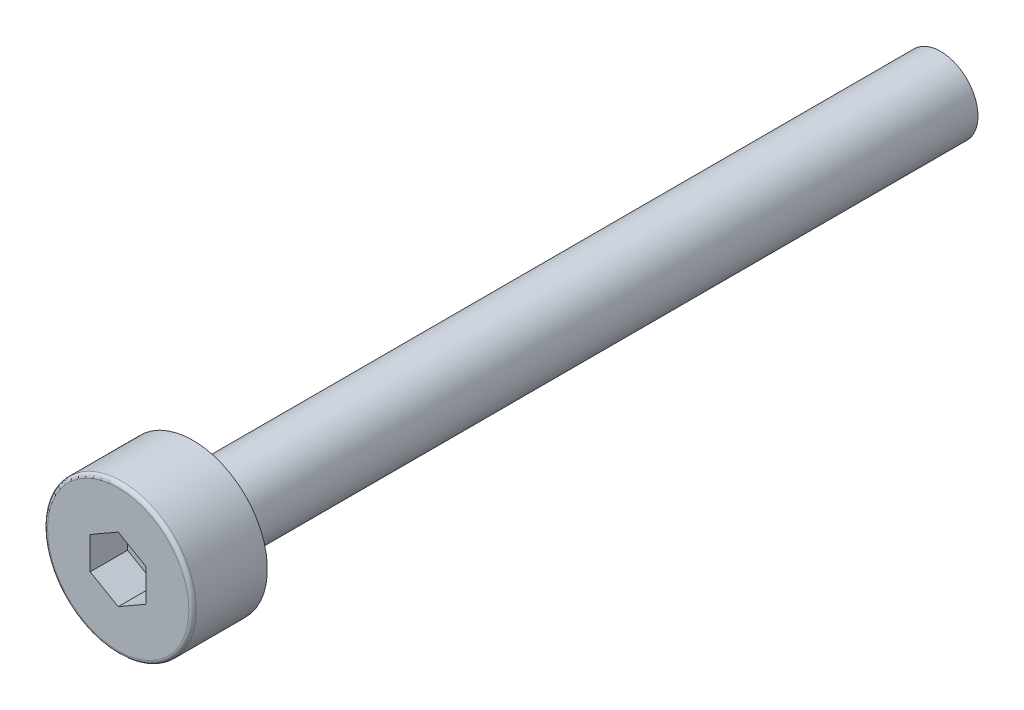
ISO-10303-21;
HEADER;
FILE_DESCRIPTION(('STEP AP214'),'2;1');
FILE_NAME('part.step','',(''),(''),'','','');
FILE_SCHEMA(('AUTOMOTIVE_DESIGN { 1 0 10303 214 1 1 1 1 }'));
ENDSEC;
DATA;
#1=APPLICATION_CONTEXT('core data for automotive mechanical design processes');
#2=APPLICATION_PROTOCOL_DEFINITION('international standard','automotive_design',2000,#1);
#3=PRODUCT_CONTEXT('',#1,'mechanical');
#4=PRODUCT('Part','Part','',(#3));
#5=PRODUCT_RELATED_PRODUCT_CATEGORY('part','',(#4));
#6=PRODUCT_DEFINITION_FORMATION('','',#4);
#7=PRODUCT_DEFINITION_CONTEXT('part definition',#1,'design');
#8=PRODUCT_DEFINITION('design','',#6,#7);
#9=PRODUCT_DEFINITION_SHAPE('','',#8);
#10=(LENGTH_UNIT() NAMED_UNIT(*) SI_UNIT(.MILLI.,.METRE.));
#11=(NAMED_UNIT(*) PLANE_ANGLE_UNIT() SI_UNIT($,.RADIAN.));
#12=(NAMED_UNIT(*) SI_UNIT($,.STERADIAN.) SOLID_ANGLE_UNIT());
#13=UNCERTAINTY_MEASURE_WITH_UNIT(LENGTH_MEASURE(1.E-05),#10,'distance_accuracy_value','');
#14=(GEOMETRIC_REPRESENTATION_CONTEXT(3) GLOBAL_UNCERTAINTY_ASSIGNED_CONTEXT((#13)) GLOBAL_UNIT_ASSIGNED_CONTEXT((#10,
#11,#12)) REPRESENTATION_CONTEXT('',''));
#15=CARTESIAN_POINT('',(0.,0.,0.));
#16=DIRECTION('',(0.,0.,1.));
#17=DIRECTION('',(1.,0.,0.));
#18=AXIS2_PLACEMENT_3D('',#15,#16,#17);
#19=CARTESIAN_POINT('',(0.,0.,1.));
#20=DIRECTION('',(0.,0.,1.));
#21=DIRECTION('',(1.,0.,0.));
#22=AXIS2_PLACEMENT_3D('',#19,#20,#21);
#23=PLANE('',#22);
#24=DIRECTION('',(-0.866025403784439,-0.5,0.));
#25=VECTOR('',#24,1.);
#26=CARTESIAN_POINT('',(0.,0.865000000000001,1.));
#27=LINE('',#26,#25);
#28=CARTESIAN_POINT('',(0.,0.865000000000001,1.));
#29=VERTEX_POINT('',#28);
#30=CARTESIAN_POINT('',(-0.749111974273539,0.4325,1.));
#31=VERTEX_POINT('',#30);
#32=EDGE_CURVE('E61',#29,#31,#27,.T.);
#33=ORIENTED_EDGE('',*,*,#32,.T.);
#34=DIRECTION('',(0.,1.,0.));
#35=VECTOR('',#34,1.);
#36=CARTESIAN_POINT('',(-0.749111974273539,0.4325,1.));
#37=LINE('',#36,#35);
#38=CARTESIAN_POINT('',(-0.749111974273539,-0.4325,1.));
#39=VERTEX_POINT('',#38);
#40=EDGE_CURVE('E63',#31,#39,#37,.F.);
#41=ORIENTED_EDGE('',*,*,#40,.T.);
#42=DIRECTION('',(0.866025403784439,-0.5,0.));
#43=VECTOR('',#42,1.);
#44=CARTESIAN_POINT('',(-0.749111974273539,-0.4325,1.));
#45=LINE('',#44,#43);
#46=CARTESIAN_POINT('',(0.,-0.865,1.));
#47=VERTEX_POINT('',#46);
#48=EDGE_CURVE('E65',#39,#47,#45,.T.);
#49=ORIENTED_EDGE('',*,*,#48,.T.);
#50=DIRECTION('',(0.866025403784438,0.5,0.));
#51=VECTOR('',#50,1.);
#52=CARTESIAN_POINT('',(0.,-0.865,1.));
#53=LINE('',#52,#51);
#54=CARTESIAN_POINT('',(0.749111974273539,-0.4325,1.));
#55=VERTEX_POINT('',#54);
#56=EDGE_CURVE('E134',#47,#55,#53,.T.);
#57=ORIENTED_EDGE('',*,*,#56,.T.);
#58=DIRECTION('',(0.,1.,0.));
#59=VECTOR('',#58,1.);
#60=CARTESIAN_POINT('',(0.749111974273539,-0.4325,1.));
#61=LINE('',#60,#59);
#62=CARTESIAN_POINT('',(0.749111974273539,0.432500000000001,1.));
#63=VERTEX_POINT('',#62);
#64=EDGE_CURVE('E140',#55,#63,#61,.T.);
#65=ORIENTED_EDGE('',*,*,#64,.T.);
#66=DIRECTION('',(-0.866025403784439,0.5,0.));
#67=VECTOR('',#66,1.);
#68=CARTESIAN_POINT('',(0.749111974273539,0.432500000000001,1.));
#69=LINE('',#68,#67);
#70=EDGE_CURVE('E145',#63,#29,#69,.T.);
#71=ORIENTED_EDGE('',*,*,#70,.T.);
#72=EDGE_LOOP('',(#33,#41,#49,#57,#65,#71));
#73=FACE_BOUND('',#72,.T.);
#74=ADVANCED_FACE('F17',(#73),#23,.T.);
#75=CARTESIAN_POINT('',(-0.749111974273539,-0.4325,1.));
#76=DIRECTION('',(-0.5,-0.866025403784439,0.));
#77=DIRECTION('',(0.866025403784439,-0.5,0.));
#78=AXIS2_PLACEMENT_3D('',#75,#76,#77);
#79=PLANE('',#78);
#80=DIRECTION('',(0.,0.,1.));
#81=VECTOR('',#80,1.);
#82=CARTESIAN_POINT('',(0.,-0.865,1.));
#83=LINE('',#82,#81);
#84=CARTESIAN_POINT('',(0.,-0.865,2.));
#85=VERTEX_POINT('',#84);
#86=EDGE_CURVE('E79',#85,#47,#83,.F.);
#87=ORIENTED_EDGE('',*,*,#86,.T.);
#88=ORIENTED_EDGE('',*,*,#48,.F.);
#89=DIRECTION('',(0.,0.,1.));
#90=VECTOR('',#89,1.);
#91=CARTESIAN_POINT('',(-0.749111974273539,-0.4325,1.));
#92=LINE('',#91,#90);
#93=CARTESIAN_POINT('',(-0.749111974273539,-0.4325,2.));
#94=VERTEX_POINT('',#93);
#95=EDGE_CURVE('E71',#39,#94,#92,.T.);
#96=ORIENTED_EDGE('',*,*,#95,.T.);
#97=DIRECTION('',(-0.866025403784439,0.5,0.));
#98=VECTOR('',#97,1.);
#99=CARTESIAN_POINT('',(0.,-0.865,2.));
#100=LINE('',#99,#98);
#101=EDGE_CURVE('E133',#85,#94,#100,.T.);
#102=ORIENTED_EDGE('',*,*,#101,.F.);
#103=EDGE_LOOP('',(#87,#88,#96,#102));
#104=FACE_BOUND('',#103,.T.);
#105=ADVANCED_FACE('F75',(#104),#79,.F.);
#106=CARTESIAN_POINT('',(-0.749111974273539,0.4325,1.));
#107=DIRECTION('',(-1.,0.,0.));
#108=DIRECTION('',(0.,0.,1.));
#109=AXIS2_PLACEMENT_3D('',#106,#107,#108);
#110=PLANE('',#109);
#111=ORIENTED_EDGE('',*,*,#95,.F.);
#112=ORIENTED_EDGE('',*,*,#40,.F.);
#113=DIRECTION('',(0.,0.,1.));
#114=VECTOR('',#113,1.);
#115=CARTESIAN_POINT('',(-0.749111974273539,0.4325,1.));
#116=LINE('',#115,#114);
#117=CARTESIAN_POINT('',(-0.749111974273539,0.4325,2.));
#118=VERTEX_POINT('',#117);
#119=EDGE_CURVE('E87',#31,#118,#116,.T.);
#120=ORIENTED_EDGE('',*,*,#119,.T.);
#121=DIRECTION('',(0.,1.,0.));
#122=VECTOR('',#121,1.);
#123=CARTESIAN_POINT('',(-0.749111974273539,0.,2.));
#124=LINE('',#123,#122);
#125=EDGE_CURVE('E84',#94,#118,#124,.T.);
#126=ORIENTED_EDGE('',*,*,#125,.F.);
#127=EDGE_LOOP('',(#111,#112,#120,#126));
#128=FACE_BOUND('',#127,.T.);
#129=ADVANCED_FACE('F82',(#128),#110,.F.);
#130=CARTESIAN_POINT('',(0.,0.865000000000001,1.));
#131=DIRECTION('',(-0.5,0.866025403784439,0.));
#132=DIRECTION('',(-0.866025403784439,-0.5,0.));
#133=AXIS2_PLACEMENT_3D('',#130,#131,#132);
#134=PLANE('',#133);
#135=ORIENTED_EDGE('',*,*,#119,.F.);
#136=ORIENTED_EDGE('',*,*,#32,.F.);
#137=DIRECTION('',(0.,0.,1.));
#138=VECTOR('',#137,1.);
#139=CARTESIAN_POINT('',(0.,0.865000000000001,1.));
#140=LINE('',#139,#138);
#141=CARTESIAN_POINT('',(0.,0.865000000000001,2.));
#142=VERTEX_POINT('',#141);
#143=EDGE_CURVE('E142',#29,#142,#140,.T.);
#144=ORIENTED_EDGE('',*,*,#143,.T.);
#145=DIRECTION('',(0.866025403784439,0.5,0.));
#146=VECTOR('',#145,1.);
#147=CARTESIAN_POINT('',(-0.749111974273539,0.4325,2.));
#148=LINE('',#147,#146);
#149=EDGE_CURVE('E152',#118,#142,#148,.T.);
#150=ORIENTED_EDGE('',*,*,#149,.F.);
#151=EDGE_LOOP('',(#135,#136,#144,#150));
#152=FACE_BOUND('',#151,.T.);
#153=ADVANCED_FACE('F153',(#152),#134,.F.);
#154=CARTESIAN_POINT('',(0.749111974273539,0.432500000000001,1.));
#155=DIRECTION('',(0.5,0.866025403784439,0.));
#156=DIRECTION('',(-0.866025403784439,0.5,0.));
#157=AXIS2_PLACEMENT_3D('',#154,#155,#156);
#158=PLANE('',#157);
#159=ORIENTED_EDGE('',*,*,#143,.F.);
#160=ORIENTED_EDGE('',*,*,#70,.F.);
#161=DIRECTION('',(0.,0.,-1.));
#162=VECTOR('',#161,1.);
#163=CARTESIAN_POINT('',(0.749111974273539,0.432500000000001,1.));
#164=LINE('',#163,#162);
#165=CARTESIAN_POINT('',(0.749111974273539,0.432500000000001,2.));
#166=VERTEX_POINT('',#165);
#167=EDGE_CURVE('E137',#63,#166,#164,.F.);
#168=ORIENTED_EDGE('',*,*,#167,.T.);
#169=DIRECTION('',(0.866025403784439,-0.5,0.));
#170=VECTOR('',#169,1.);
#171=CARTESIAN_POINT('',(0.,0.865000000000001,2.));
#172=LINE('',#171,#170);
#173=EDGE_CURVE('E158',#142,#166,#172,.T.);
#174=ORIENTED_EDGE('',*,*,#173,.F.);
#175=EDGE_LOOP('',(#159,#160,#168,#174));
#176=FACE_BOUND('',#175,.T.);
#177=ADVANCED_FACE('F241',(#176),#158,.F.);
#178=CARTESIAN_POINT('',(0.749111974273539,-0.4325,1.));
#179=DIRECTION('',(1.,0.,0.));
#180=DIRECTION('',(0.,0.,-1.));
#181=AXIS2_PLACEMENT_3D('',#178,#179,#180);
#182=PLANE('',#181);
#183=ORIENTED_EDGE('',*,*,#167,.F.);
#184=ORIENTED_EDGE('',*,*,#64,.F.);
#185=DIRECTION('',(0.,0.,1.));
#186=VECTOR('',#185,1.);
#187=CARTESIAN_POINT('',(0.749111974273539,-0.432499999999999,1.));
#188=LINE('',#187,#186);
#189=CARTESIAN_POINT('',(0.749111974273539,-0.4325,2.));
#190=VERTEX_POINT('',#189);
#191=EDGE_CURVE('E125',#55,#190,#188,.T.);
#192=ORIENTED_EDGE('',*,*,#191,.T.);
#193=DIRECTION('',(0.,1.,0.));
#194=VECTOR('',#193,1.);
#195=CARTESIAN_POINT('',(0.749111974273539,0.,2.));
#196=LINE('',#195,#194);
#197=EDGE_CURVE('E166',#166,#190,#196,.F.);
#198=ORIENTED_EDGE('',*,*,#197,.F.);
#199=EDGE_LOOP('',(#183,#184,#192,#198));
#200=FACE_BOUND('',#199,.T.);
#201=ADVANCED_FACE('F191',(#200),#182,.F.);
#202=CARTESIAN_POINT('',(0.,-0.865,1.));
#203=DIRECTION('',(0.5,-0.866025403784438,0.));
#204=DIRECTION('',(0.866025403784438,0.5,0.));
#205=AXIS2_PLACEMENT_3D('',#202,#203,#204);
#206=PLANE('',#205);
#207=ORIENTED_EDGE('',*,*,#191,.F.);
#208=ORIENTED_EDGE('',*,*,#56,.F.);
#209=ORIENTED_EDGE('',*,*,#86,.F.);
#210=DIRECTION('',(-0.866025403784438,-0.5,0.));
#211=VECTOR('',#210,1.);
#212=CARTESIAN_POINT('',(0.749111974273539,-0.4325,2.));
#213=LINE('',#212,#211);
#214=EDGE_CURVE('E168',#190,#85,#213,.T.);
#215=ORIENTED_EDGE('',*,*,#214,.F.);
#216=EDGE_LOOP('',(#207,#208,#209,#215));
#217=FACE_BOUND('',#216,.T.);
#218=ADVANCED_FACE('F186',(#217),#206,.F.);
#219=CARTESIAN_POINT('',(0.,0.,2.));
#220=DIRECTION('',(0.,0.,1.));
#221=DIRECTION('',(1.,0.,0.));
#222=AXIS2_PLACEMENT_3D('',#219,#220,#221);
#223=PLANE('',#222);
#224=ORIENTED_EDGE('',*,*,#197,.T.);
#225=ORIENTED_EDGE('',*,*,#214,.T.);
#226=ORIENTED_EDGE('',*,*,#101,.T.);
#227=ORIENTED_EDGE('',*,*,#125,.T.);
#228=ORIENTED_EDGE('',*,*,#149,.T.);
#229=ORIENTED_EDGE('',*,*,#173,.T.);
#230=EDGE_LOOP('',(#224,#225,#226,#227,#228,#229));
#231=FACE_BOUND('',#230,.T.);
#232=CARTESIAN_POINT('',(0.,0.,2.));
#233=DIRECTION('',(0.,0.,-1.));
#234=DIRECTION('',(-1.,0.,0.));
#235=AXIS2_PLACEMENT_3D('',#232,#233,#234);
#236=CIRCLE('',#235,1.89);
#237=CARTESIAN_POINT('',(-1.89,0.,2.));
#238=VERTEX_POINT('',#237);
#239=CARTESIAN_POINT('',(1.89,0.,2.));
#240=VERTEX_POINT('',#239);
#241=EDGE_CURVE('E36',#238,#240,#236,.T.);
#242=ORIENTED_EDGE('',*,*,#241,.F.);
#243=CARTESIAN_POINT('',(0.,0.,2.));
#244=DIRECTION('',(0.,0.,-1.));
#245=DIRECTION('',(1.,0.,0.));
#246=AXIS2_PLACEMENT_3D('',#243,#244,#245);
#247=CIRCLE('',#246,1.89);
#248=EDGE_CURVE('E99',#240,#238,#247,.T.);
#249=ORIENTED_EDGE('',*,*,#248,.F.);
#250=EDGE_LOOP('',(#242,#249));
#251=FACE_BOUND('',#250,.T.);
#252=ADVANCED_FACE('F113',(#231,#251),#223,.T.);
#253=CARTESIAN_POINT('',(0.,0.,1.9));
#254=DIRECTION('',(0.,0.,1.));
#255=DIRECTION('',(1.,0.,0.));
#256=AXIS2_PLACEMENT_3D('',#253,#254,#255);
#257=TOROIDAL_SURFACE('',#256,1.89,0.1);
#258=CARTESIAN_POINT('',(0.,0.,1.9));
#259=DIRECTION('',(0.,0.,-1.));
#260=DIRECTION('',(-1.,0.,0.));
#261=AXIS2_PLACEMENT_3D('',#258,#259,#260);
#262=CIRCLE('',#261,1.99);
#263=CARTESIAN_POINT('',(-1.99,0.,1.9));
#264=VERTEX_POINT('',#263);
#265=EDGE_CURVE('E95',#264,#264,#262,.T.);
#266=ORIENTED_EDGE('',*,*,#265,.F.);
#267=EDGE_LOOP('',(#266));
#268=FACE_BOUND('',#267,.T.);
#269=ORIENTED_EDGE('',*,*,#248,.T.);
#270=ORIENTED_EDGE('',*,*,#241,.T.);
#271=EDGE_LOOP('',(#269,#270));
#272=FACE_BOUND('',#271,.T.);
#273=ADVANCED_FACE('F107',(#268,#272),#257,.T.);
#274=CARTESIAN_POINT('',(0.,0.,2.));
#275=DIRECTION('',(0.,0.,-1.));
#276=DIRECTION('',(-1.,0.,0.));
#277=AXIS2_PLACEMENT_3D('',#274,#275,#276);
#278=CYLINDRICAL_SURFACE('',#277,1.99);
#279=ORIENTED_EDGE('',*,*,#265,.T.);
#280=EDGE_LOOP('',(#279));
#281=FACE_BOUND('',#280,.T.);
#282=CARTESIAN_POINT('',(0.,0.,0.));
#283=DIRECTION('',(0.,0.,-1.));
#284=DIRECTION('',(-1.,0.,0.));
#285=AXIS2_PLACEMENT_3D('',#282,#283,#284);
#286=CIRCLE('',#285,1.99);
#287=CARTESIAN_POINT('',(-1.99,0.,0.));
#288=VERTEX_POINT('',#287);
#289=EDGE_CURVE('E93',#288,#288,#286,.F.);
#290=ORIENTED_EDGE('',*,*,#289,.T.);
#291=EDGE_LOOP('',(#290));
#292=FACE_BOUND('',#291,.T.);
#293=ADVANCED_FACE('F112',(#281,#292),#278,.T.);
#294=CARTESIAN_POINT('',(0.,0.,-20.));
#295=DIRECTION('',(0.,0.,-1.));
#296=DIRECTION('',(-1.,0.,0.));
#297=AXIS2_PLACEMENT_3D('',#294,#295,#296);
#298=PLANE('',#297);
#299=CARTESIAN_POINT('',(0.,0.,-20.));
#300=DIRECTION('',(0.,0.,1.));
#301=DIRECTION('',(1.,0.,0.));
#302=AXIS2_PLACEMENT_3D('',#299,#300,#301);
#303=CIRCLE('',#302,1.);
#304=CARTESIAN_POINT('',(1.,0.,-20.));
#305=VERTEX_POINT('',#304);
#306=EDGE_CURVE('E28',#305,#305,#303,.T.);
#307=ORIENTED_EDGE('',*,*,#306,.F.);
#308=EDGE_LOOP('',(#307));
#309=FACE_BOUND('',#308,.T.);
#310=ADVANCED_FACE('F201',(#309),#298,.T.);
#311=CARTESIAN_POINT('',(0.,0.,0.));
#312=DIRECTION('',(0.,0.,1.));
#313=DIRECTION('',(1.,0.,0.));
#314=AXIS2_PLACEMENT_3D('',#311,#312,#313);
#315=PLANE('',#314);
#316=CARTESIAN_POINT('',(0.,0.,0.));
#317=DIRECTION('',(0.,0.,1.));
#318=DIRECTION('',(1.,0.,0.));
#319=AXIS2_PLACEMENT_3D('',#316,#317,#318);
#320=CIRCLE('',#319,1.);
#321=CARTESIAN_POINT('',(1.,0.,0.));
#322=VERTEX_POINT('',#321);
#323=EDGE_CURVE('E11',#322,#322,#320,.F.);
#324=ORIENTED_EDGE('',*,*,#323,.F.);
#325=EDGE_LOOP('',(#324));
#326=FACE_BOUND('',#325,.T.);
#327=ORIENTED_EDGE('',*,*,#289,.F.);
#328=EDGE_LOOP('',(#327));
#329=FACE_BOUND('',#328,.T.);
#330=ADVANCED_FACE('F195',(#326,#329),#315,.F.);
#331=CARTESIAN_POINT('',(0.,0.,-20.));
#332=DIRECTION('',(0.,0.,1.));
#333=DIRECTION('',(1.,0.,0.));
#334=AXIS2_PLACEMENT_3D('',#331,#332,#333);
#335=CYLINDRICAL_SURFACE('',#334,1.);
#336=ORIENTED_EDGE('',*,*,#323,.T.);
#337=EDGE_LOOP('',(#336));
#338=FACE_BOUND('',#337,.T.);
#339=ORIENTED_EDGE('',*,*,#306,.T.);
#340=EDGE_LOOP('',(#339));
#341=FACE_BOUND('',#340,.T.);
#342=ADVANCED_FACE('F193',(#338,#341),#335,.T.);
#343=CLOSED_SHELL('',(#74,#105,#129,#153,#177,#201,#218,#252,#273,#293,#310,#330,#342));
#344=MANIFOLD_SOLID_BREP('B1',#343);
#345=ADVANCED_BREP_SHAPE_REPRESENTATION('',(#18,#344),#14);
#346=SHAPE_DEFINITION_REPRESENTATION(#9,#345);
ENDSEC;
END-ISO-10303-21;
